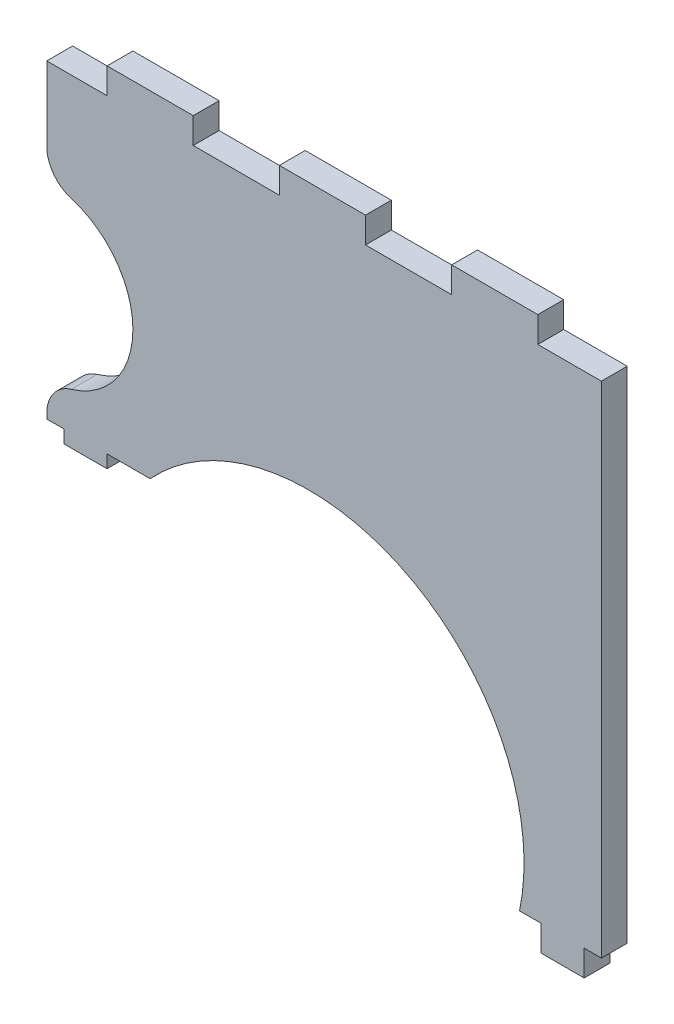
ISO-10303-21;
HEADER;
FILE_DESCRIPTION(('STEP AP214'),'2;1');
FILE_NAME('part.step','',(''),(''),'','','');
FILE_SCHEMA(('AUTOMOTIVE_DESIGN { 1 0 10303 214 1 1 1 1 }'));
ENDSEC;
DATA;
#1=APPLICATION_CONTEXT('core data for automotive mechanical design processes');
#2=APPLICATION_PROTOCOL_DEFINITION('international standard','automotive_design',2000,#1);
#3=PRODUCT_CONTEXT('',#1,'mechanical');
#4=PRODUCT('Part','Part','',(#3));
#5=PRODUCT_RELATED_PRODUCT_CATEGORY('part','',(#4));
#6=PRODUCT_DEFINITION_FORMATION('','',#4);
#7=PRODUCT_DEFINITION_CONTEXT('part definition',#1,'design');
#8=PRODUCT_DEFINITION('design','',#6,#7);
#9=PRODUCT_DEFINITION_SHAPE('','',#8);
#10=(LENGTH_UNIT() NAMED_UNIT(*) SI_UNIT(.MILLI.,.METRE.));
#11=(NAMED_UNIT(*) PLANE_ANGLE_UNIT() SI_UNIT($,.RADIAN.));
#12=(NAMED_UNIT(*) SI_UNIT($,.STERADIAN.) SOLID_ANGLE_UNIT());
#13=UNCERTAINTY_MEASURE_WITH_UNIT(LENGTH_MEASURE(1.E-05),#10,'distance_accuracy_value','');
#14=(GEOMETRIC_REPRESENTATION_CONTEXT(3) GLOBAL_UNCERTAINTY_ASSIGNED_CONTEXT((#13)) GLOBAL_UNIT_ASSIGNED_CONTEXT((#10,
#11,#12)) REPRESENTATION_CONTEXT('',''));
#15=CARTESIAN_POINT('',(0.,0.,0.));
#16=DIRECTION('',(0.,0.,1.));
#17=DIRECTION('',(1.,0.,0.));
#18=AXIS2_PLACEMENT_3D('',#15,#16,#17);
#19=CARTESIAN_POINT('',(-62.38,0.,3.));
#20=DIRECTION('',(1.,0.,0.));
#21=DIRECTION('',(0.,0.,-1.));
#22=AXIS2_PLACEMENT_3D('',#19,#20,#21);
#23=PLANE('',#22);
#24=DIRECTION('',(0.,-1.,0.));
#25=VECTOR('',#24,1.);
#26=CARTESIAN_POINT('',(-62.38,0.,0.));
#27=LINE('',#26,#25);
#28=CARTESIAN_POINT('',(-62.38,58.,0.));
#29=VERTEX_POINT('',#28);
#30=CARTESIAN_POINT('',(-62.38,49.4164078649987,0.));
#31=VERTEX_POINT('',#30);
#32=EDGE_CURVE('E363',#29,#31,#27,.T.);
#33=ORIENTED_EDGE('',*,*,#32,.T.);
#34=DIRECTION('',(0.,0.,1.));
#35=VECTOR('',#34,1.);
#36=CARTESIAN_POINT('',(-62.38,49.4164078649987,3.));
#37=LINE('',#36,#35);
#38=CARTESIAN_POINT('',(-62.38,49.4164078649987,3.));
#39=VERTEX_POINT('',#38);
#40=EDGE_CURVE('E11',#31,#39,#37,.T.);
#41=ORIENTED_EDGE('',*,*,#40,.T.);
#42=DIRECTION('',(0.,-1.,0.));
#43=VECTOR('',#42,1.);
#44=CARTESIAN_POINT('',(-62.38,0.,3.));
#45=LINE('',#44,#43);
#46=CARTESIAN_POINT('',(-62.38,58.,3.));
#47=VERTEX_POINT('',#46);
#48=EDGE_CURVE('E302',#47,#39,#45,.T.);
#49=ORIENTED_EDGE('',*,*,#48,.F.);
#50=DIRECTION('',(0.,0.,-1.));
#51=VECTOR('',#50,1.);
#52=CARTESIAN_POINT('',(-62.38,58.,3.));
#53=LINE('',#52,#51);
#54=EDGE_CURVE('E383',#47,#29,#53,.T.);
#55=ORIENTED_EDGE('',*,*,#54,.T.);
#56=EDGE_LOOP('',(#33,#41,#49,#55));
#57=FACE_BOUND('',#56,.T.);
#58=ADVANCED_FACE('F39',(#57),#23,.F.);
#59=CARTESIAN_POINT('',(0.,21.9999999999999,3.));
#60=DIRECTION('',(0.,1.,0.));
#61=DIRECTION('',(-1.,0.,0.));
#62=AXIS2_PLACEMENT_3D('',#59,#60,#61);
#63=PLANE('',#62);
#64=DIRECTION('',(1.,0.,0.));
#65=VECTOR('',#64,1.);
#66=CARTESIAN_POINT('',(0.,21.9999999999999,0.));
#67=LINE('',#66,#65);
#68=CARTESIAN_POINT('',(-55.38,22.,0.));
#69=VERTEX_POINT('',#68);
#70=CARTESIAN_POINT('',(-50.38,22.,0.));
#71=VERTEX_POINT('',#70);
#72=EDGE_CURVE('E265',#69,#71,#67,.T.);
#73=ORIENTED_EDGE('',*,*,#72,.T.);
#74=DIRECTION('',(0.,0.,-1.));
#75=VECTOR('',#74,1.);
#76=CARTESIAN_POINT('',(-50.38,22.,3.));
#77=LINE('',#76,#75);
#78=CARTESIAN_POINT('',(-50.38,22.,3.));
#79=VERTEX_POINT('',#78);
#80=EDGE_CURVE('E244',#79,#71,#77,.T.);
#81=ORIENTED_EDGE('',*,*,#80,.F.);
#82=DIRECTION('',(1.,0.,0.));
#83=VECTOR('',#82,1.);
#84=CARTESIAN_POINT('',(0.,21.9999999999999,3.));
#85=LINE('',#84,#83);
#86=CARTESIAN_POINT('',(-55.38,22.,3.));
#87=VERTEX_POINT('',#86);
#88=EDGE_CURVE('E251',#87,#79,#85,.T.);
#89=ORIENTED_EDGE('',*,*,#88,.F.);
#90=DIRECTION('',(0.,0.,-1.));
#91=VECTOR('',#90,1.);
#92=CARTESIAN_POINT('',(-55.38,22.,3.));
#93=LINE('',#92,#91);
#94=EDGE_CURVE('E317',#87,#69,#93,.T.);
#95=ORIENTED_EDGE('',*,*,#94,.T.);
#96=EDGE_LOOP('',(#73,#81,#89,#95));
#97=FACE_BOUND('',#96,.T.);
#98=ADVANCED_FACE('F263',(#97),#63,.F.);
#99=CARTESIAN_POINT('',(-31.9791901639315,5.07634208048251,3.));
#100=DIRECTION('',(0.,0.,-1.));
#101=DIRECTION('',(-1.,0.,0.));
#102=AXIS2_PLACEMENT_3D('',#99,#100,#101);
#103=CYLINDRICAL_SURFACE('',#102,25.);
#104=CARTESIAN_POINT('',(-31.9791901639315,5.07634208048251,0.));
#105=DIRECTION('',(0.,0.,1.));
#106=DIRECTION('',(1.,0.,0.));
#107=AXIS2_PLACEMENT_3D('',#104,#105,#106);
#108=CIRCLE('',#107,25.);
#109=CARTESIAN_POINT('',(-7.50000000000001,0.,0.));
#110=VERTEX_POINT('',#109);
#111=EDGE_CURVE('E319',#71,#110,#108,.F.);
#112=ORIENTED_EDGE('',*,*,#111,.T.);
#113=DIRECTION('',(0.,0.,-1.));
#114=VECTOR('',#113,1.);
#115=CARTESIAN_POINT('',(-7.50000000000001,0.,3.));
#116=LINE('',#115,#114);
#117=CARTESIAN_POINT('',(-7.50000000000001,0.,3.));
#118=VERTEX_POINT('',#117);
#119=EDGE_CURVE('E246',#118,#110,#116,.T.);
#120=ORIENTED_EDGE('',*,*,#119,.F.);
#121=CARTESIAN_POINT('',(-31.9791901639315,5.07634208048251,3.));
#122=DIRECTION('',(0.,0.,1.));
#123=DIRECTION('',(1.,0.,0.));
#124=AXIS2_PLACEMENT_3D('',#121,#122,#123);
#125=CIRCLE('',#124,25.);
#126=EDGE_CURVE('E239',#79,#118,#125,.F.);
#127=ORIENTED_EDGE('',*,*,#126,.F.);
#128=ORIENTED_EDGE('',*,*,#80,.T.);
#129=EDGE_LOOP('',(#112,#120,#127,#128));
#130=FACE_BOUND('',#129,.T.);
#131=ADVANCED_FACE('F242',(#130),#103,.F.);
#132=CARTESIAN_POINT('',(0.,0.,3.));
#133=DIRECTION('',(0.,-1.,0.));
#134=DIRECTION('',(1.,0.,0.));
#135=AXIS2_PLACEMENT_3D('',#132,#133,#134);
#136=PLANE('',#135);
#137=DIRECTION('',(-1.,0.,0.));
#138=VECTOR('',#137,1.);
#139=CARTESIAN_POINT('',(0.,0.,0.));
#140=LINE('',#139,#138);
#141=CARTESIAN_POINT('',(-5.,0.,0.));
#142=VERTEX_POINT('',#141);
#143=EDGE_CURVE('E321',#142,#110,#140,.T.);
#144=ORIENTED_EDGE('',*,*,#143,.F.);
#145=DIRECTION('',(0.,0.,-1.));
#146=VECTOR('',#145,1.);
#147=CARTESIAN_POINT('',(-5.,0.,3.));
#148=LINE('',#147,#146);
#149=CARTESIAN_POINT('',(-5.,0.,3.));
#150=VERTEX_POINT('',#149);
#151=EDGE_CURVE('E270',#150,#142,#148,.T.);
#152=ORIENTED_EDGE('',*,*,#151,.F.);
#153=DIRECTION('',(-1.,0.,0.));
#154=VECTOR('',#153,1.);
#155=CARTESIAN_POINT('',(0.,0.,3.));
#156=LINE('',#155,#154);
#157=EDGE_CURVE('E250',#150,#118,#156,.T.);
#158=ORIENTED_EDGE('',*,*,#157,.T.);
#159=ORIENTED_EDGE('',*,*,#119,.T.);
#160=EDGE_LOOP('',(#144,#152,#158,#159));
#161=FACE_BOUND('',#160,.T.);
#162=ADVANCED_FACE('F441',(#161),#136,.T.);
#163=CARTESIAN_POINT('',(-5.,0.,3.));
#164=DIRECTION('',(-1.,0.,0.));
#165=DIRECTION('',(0.,0.,1.));
#166=AXIS2_PLACEMENT_3D('',#163,#164,#165);
#167=PLANE('',#166);
#168=DIRECTION('',(0.,1.,0.));
#169=VECTOR('',#168,1.);
#170=CARTESIAN_POINT('',(-5.,0.,0.));
#171=LINE('',#170,#169);
#172=CARTESIAN_POINT('',(-5.,-3.,0.));
#173=VERTEX_POINT('',#172);
#174=EDGE_CURVE('E324',#173,#142,#171,.T.);
#175=ORIENTED_EDGE('',*,*,#174,.F.);
#176=DIRECTION('',(0.,0.,-1.));
#177=VECTOR('',#176,1.);
#178=CARTESIAN_POINT('',(-5.,-3.,3.));
#179=LINE('',#178,#177);
#180=CARTESIAN_POINT('',(-5.,-3.,3.));
#181=VERTEX_POINT('',#180);
#182=EDGE_CURVE('E432',#181,#173,#179,.T.);
#183=ORIENTED_EDGE('',*,*,#182,.F.);
#184=DIRECTION('',(0.,1.,0.));
#185=VECTOR('',#184,1.);
#186=CARTESIAN_POINT('',(-5.,0.,3.));
#187=LINE('',#186,#185);
#188=EDGE_CURVE('E439',#181,#150,#187,.T.);
#189=ORIENTED_EDGE('',*,*,#188,.T.);
#190=ORIENTED_EDGE('',*,*,#151,.T.);
#191=EDGE_LOOP('',(#175,#183,#189,#190));
#192=FACE_BOUND('',#191,.T.);
#193=ADVANCED_FACE('F437',(#192),#167,.T.);
#194=CARTESIAN_POINT('',(0.,-3.,3.));
#195=DIRECTION('',(0.,-1.,0.));
#196=DIRECTION('',(1.,0.,0.));
#197=AXIS2_PLACEMENT_3D('',#194,#195,#196);
#198=PLANE('',#197);
#199=DIRECTION('',(-1.,0.,0.));
#200=VECTOR('',#199,1.);
#201=CARTESIAN_POINT('',(0.,-3.,0.));
#202=LINE('',#201,#200);
#203=CARTESIAN_POINT('',(0.,-3.,0.));
#204=VERTEX_POINT('',#203);
#205=EDGE_CURVE('E327',#204,#173,#202,.T.);
#206=ORIENTED_EDGE('',*,*,#205,.F.);
#207=DIRECTION('',(0.,0.,-1.));
#208=VECTOR('',#207,1.);
#209=CARTESIAN_POINT('',(0.,-3.,3.));
#210=LINE('',#209,#208);
#211=CARTESIAN_POINT('',(0.,-3.,3.));
#212=VERTEX_POINT('',#211);
#213=EDGE_CURVE('E430',#212,#204,#210,.T.);
#214=ORIENTED_EDGE('',*,*,#213,.F.);
#215=DIRECTION('',(-1.,0.,0.));
#216=VECTOR('',#215,1.);
#217=CARTESIAN_POINT('',(0.,-3.,3.));
#218=LINE('',#217,#216);
#219=EDGE_CURVE('E449',#212,#181,#218,.T.);
#220=ORIENTED_EDGE('',*,*,#219,.T.);
#221=ORIENTED_EDGE('',*,*,#182,.T.);
#222=EDGE_LOOP('',(#206,#214,#220,#221));
#223=FACE_BOUND('',#222,.T.);
#224=ADVANCED_FACE('F446',(#223),#198,.T.);
#225=CARTESIAN_POINT('',(0.,0.,3.));
#226=DIRECTION('',(1.,0.,0.));
#227=DIRECTION('',(0.,1.,0.));
#228=AXIS2_PLACEMENT_3D('',#225,#226,#227);
#229=PLANE('',#228);
#230=DIRECTION('',(0.,-1.,0.));
#231=VECTOR('',#230,1.);
#232=CARTESIAN_POINT('',(0.,0.,0.));
#233=LINE('',#232,#231);
#234=CARTESIAN_POINT('',(0.,0.,0.));
#235=VERTEX_POINT('',#234);
#236=EDGE_CURVE('E330',#235,#204,#233,.T.);
#237=ORIENTED_EDGE('',*,*,#236,.F.);
#238=DIRECTION('',(0.,0.,-1.));
#239=VECTOR('',#238,1.);
#240=CARTESIAN_POINT('',(0.,0.,3.));
#241=LINE('',#240,#239);
#242=CARTESIAN_POINT('',(0.,0.,3.));
#243=VERTEX_POINT('',#242);
#244=EDGE_CURVE('E428',#243,#235,#241,.T.);
#245=ORIENTED_EDGE('',*,*,#244,.F.);
#246=DIRECTION('',(0.,-1.,0.));
#247=VECTOR('',#246,1.);
#248=CARTESIAN_POINT('',(0.,0.,3.));
#249=LINE('',#248,#247);
#250=EDGE_CURVE('E453',#243,#212,#249,.T.);
#251=ORIENTED_EDGE('',*,*,#250,.T.);
#252=ORIENTED_EDGE('',*,*,#213,.T.);
#253=EDGE_LOOP('',(#237,#245,#251,#252));
#254=FACE_BOUND('',#253,.T.);
#255=ADVANCED_FACE('F576',(#254),#229,.T.);
#256=CARTESIAN_POINT('',(0.,0.,3.));
#257=DIRECTION('',(0.,1.,0.));
#258=DIRECTION('',(0.,0.,1.));
#259=AXIS2_PLACEMENT_3D('',#256,#257,#258);
#260=PLANE('',#259);
#261=DIRECTION('',(1.,0.,0.));
#262=VECTOR('',#261,1.);
#263=CARTESIAN_POINT('',(0.,0.,0.));
#264=LINE('',#263,#262);
#265=CARTESIAN_POINT('',(2.,0.,0.));
#266=VERTEX_POINT('',#265);
#267=EDGE_CURVE('E333',#235,#266,#264,.T.);
#268=ORIENTED_EDGE('',*,*,#267,.T.);
#269=DIRECTION('',(0.,0.,-1.));
#270=VECTOR('',#269,1.);
#271=CARTESIAN_POINT('',(2.,0.,3.));
#272=LINE('',#271,#270);
#273=CARTESIAN_POINT('',(2.,0.,3.));
#274=VERTEX_POINT('',#273);
#275=EDGE_CURVE('E425',#274,#266,#272,.T.);
#276=ORIENTED_EDGE('',*,*,#275,.F.);
#277=DIRECTION('',(1.,0.,0.));
#278=VECTOR('',#277,1.);
#279=CARTESIAN_POINT('',(0.,0.,3.));
#280=LINE('',#279,#278);
#281=EDGE_CURVE('E458',#243,#274,#280,.T.);
#282=ORIENTED_EDGE('',*,*,#281,.F.);
#283=ORIENTED_EDGE('',*,*,#244,.T.);
#284=EDGE_LOOP('',(#268,#276,#282,#283));
#285=FACE_BOUND('',#284,.T.);
#286=ADVANCED_FACE('F572',(#285),#260,.F.);
#287=CARTESIAN_POINT('',(2.,0.,3.));
#288=DIRECTION('',(-1.,0.,0.));
#289=DIRECTION('',(0.,0.,1.));
#290=AXIS2_PLACEMENT_3D('',#287,#288,#289);
#291=PLANE('',#290);
#292=DIRECTION('',(0.,1.,0.));
#293=VECTOR('',#292,1.);
#294=CARTESIAN_POINT('',(2.,0.,0.));
#295=LINE('',#294,#293);
#296=CARTESIAN_POINT('',(2.,58.,0.));
#297=VERTEX_POINT('',#296);
#298=EDGE_CURVE('E335',#266,#297,#295,.T.);
#299=ORIENTED_EDGE('',*,*,#298,.T.);
#300=DIRECTION('',(0.,0.,-1.));
#301=VECTOR('',#300,1.);
#302=CARTESIAN_POINT('',(2.,58.,3.));
#303=LINE('',#302,#301);
#304=CARTESIAN_POINT('',(2.,58.,3.));
#305=VERTEX_POINT('',#304);
#306=EDGE_CURVE('E422',#305,#297,#303,.T.);
#307=ORIENTED_EDGE('',*,*,#306,.F.);
#308=DIRECTION('',(0.,1.,0.));
#309=VECTOR('',#308,1.);
#310=CARTESIAN_POINT('',(2.,0.,3.));
#311=LINE('',#310,#309);
#312=EDGE_CURVE('E460',#274,#305,#311,.T.);
#313=ORIENTED_EDGE('',*,*,#312,.F.);
#314=ORIENTED_EDGE('',*,*,#275,.T.);
#315=EDGE_LOOP('',(#299,#307,#313,#314));
#316=FACE_BOUND('',#315,.T.);
#317=ADVANCED_FACE('F568',(#316),#291,.F.);
#318=CARTESIAN_POINT('',(0.,58.,3.));
#319=DIRECTION('',(0.,-1.,0.));
#320=DIRECTION('',(0.,0.,-1.));
#321=AXIS2_PLACEMENT_3D('',#318,#319,#320);
#322=PLANE('',#321);
#323=DIRECTION('',(-1.,0.,0.));
#324=VECTOR('',#323,1.);
#325=CARTESIAN_POINT('',(0.,58.,0.));
#326=LINE('',#325,#324);
#327=CARTESIAN_POINT('',(-5.37999999999999,58.,0.));
#328=VERTEX_POINT('',#327);
#329=EDGE_CURVE('E337',#297,#328,#326,.T.);
#330=ORIENTED_EDGE('',*,*,#329,.T.);
#331=DIRECTION('',(0.,0.,-1.));
#332=VECTOR('',#331,1.);
#333=CARTESIAN_POINT('',(-5.37999999999999,58.,3.));
#334=LINE('',#333,#332);
#335=CARTESIAN_POINT('',(-5.37999999999999,58.,3.));
#336=VERTEX_POINT('',#335);
#337=EDGE_CURVE('E419',#336,#328,#334,.T.);
#338=ORIENTED_EDGE('',*,*,#337,.F.);
#339=DIRECTION('',(-1.,0.,0.));
#340=VECTOR('',#339,1.);
#341=CARTESIAN_POINT('',(0.,58.,3.));
#342=LINE('',#341,#340);
#343=EDGE_CURVE('E462',#305,#336,#342,.T.);
#344=ORIENTED_EDGE('',*,*,#343,.F.);
#345=ORIENTED_EDGE('',*,*,#306,.T.);
#346=EDGE_LOOP('',(#330,#338,#344,#345));
#347=FACE_BOUND('',#346,.T.);
#348=ADVANCED_FACE('F564',(#347),#322,.F.);
#349=CARTESIAN_POINT('',(-5.37999999999999,0.,3.));
#350=DIRECTION('',(-1.,0.,0.));
#351=DIRECTION('',(0.,0.,1.));
#352=AXIS2_PLACEMENT_3D('',#349,#350,#351);
#353=PLANE('',#352);
#354=DIRECTION('',(0.,1.,0.));
#355=VECTOR('',#354,1.);
#356=CARTESIAN_POINT('',(-5.37999999999999,0.,0.));
#357=LINE('',#356,#355);
#358=CARTESIAN_POINT('',(-5.37999999999999,61.,0.));
#359=VERTEX_POINT('',#358);
#360=EDGE_CURVE('E339',#328,#359,#357,.T.);
#361=ORIENTED_EDGE('',*,*,#360,.T.);
#362=DIRECTION('',(0.,0.,-1.));
#363=VECTOR('',#362,1.);
#364=CARTESIAN_POINT('',(-5.37999999999999,61.,3.));
#365=LINE('',#364,#363);
#366=CARTESIAN_POINT('',(-5.37999999999999,61.,3.));
#367=VERTEX_POINT('',#366);
#368=EDGE_CURVE('E416',#367,#359,#365,.T.);
#369=ORIENTED_EDGE('',*,*,#368,.F.);
#370=DIRECTION('',(0.,1.,0.));
#371=VECTOR('',#370,1.);
#372=CARTESIAN_POINT('',(-5.37999999999999,0.,3.));
#373=LINE('',#372,#371);
#374=EDGE_CURVE('E464',#336,#367,#373,.T.);
#375=ORIENTED_EDGE('',*,*,#374,.F.);
#376=ORIENTED_EDGE('',*,*,#337,.T.);
#377=EDGE_LOOP('',(#361,#369,#375,#376));
#378=FACE_BOUND('',#377,.T.);
#379=ADVANCED_FACE('F560',(#378),#353,.F.);
#380=CARTESIAN_POINT('',(0.,61.,3.));
#381=DIRECTION('',(0.,-1.,0.));
#382=DIRECTION('',(1.,0.,0.));
#383=AXIS2_PLACEMENT_3D('',#380,#381,#382);
#384=PLANE('',#383);
#385=DIRECTION('',(-1.,0.,0.));
#386=VECTOR('',#385,1.);
#387=CARTESIAN_POINT('',(0.,61.,0.));
#388=LINE('',#387,#386);
#389=CARTESIAN_POINT('',(-15.38,61.,0.));
#390=VERTEX_POINT('',#389);
#391=EDGE_CURVE('E341',#359,#390,#388,.T.);
#392=ORIENTED_EDGE('',*,*,#391,.T.);
#393=DIRECTION('',(0.,0.,-1.));
#394=VECTOR('',#393,1.);
#395=CARTESIAN_POINT('',(-15.38,61.,3.));
#396=LINE('',#395,#394);
#397=CARTESIAN_POINT('',(-15.38,61.,3.));
#398=VERTEX_POINT('',#397);
#399=EDGE_CURVE('E413',#398,#390,#396,.T.);
#400=ORIENTED_EDGE('',*,*,#399,.F.);
#401=DIRECTION('',(-1.,0.,0.));
#402=VECTOR('',#401,1.);
#403=CARTESIAN_POINT('',(0.,61.,3.));
#404=LINE('',#403,#402);
#405=EDGE_CURVE('E466',#367,#398,#404,.T.);
#406=ORIENTED_EDGE('',*,*,#405,.F.);
#407=ORIENTED_EDGE('',*,*,#368,.T.);
#408=EDGE_LOOP('',(#392,#400,#406,#407));
#409=FACE_BOUND('',#408,.T.);
#410=ADVANCED_FACE('F556',(#409),#384,.F.);
#411=CARTESIAN_POINT('',(-15.38,0.,3.));
#412=DIRECTION('',(1.,0.,0.));
#413=DIRECTION('',(0.,0.,-1.));
#414=AXIS2_PLACEMENT_3D('',#411,#412,#413);
#415=PLANE('',#414);
#416=DIRECTION('',(0.,-1.,0.));
#417=VECTOR('',#416,1.);
#418=CARTESIAN_POINT('',(-15.38,0.,0.));
#419=LINE('',#418,#417);
#420=CARTESIAN_POINT('',(-15.38,58.,0.));
#421=VERTEX_POINT('',#420);
#422=EDGE_CURVE('E343',#390,#421,#419,.T.);
#423=ORIENTED_EDGE('',*,*,#422,.T.);
#424=DIRECTION('',(0.,0.,-1.));
#425=VECTOR('',#424,1.);
#426=CARTESIAN_POINT('',(-15.38,58.,3.));
#427=LINE('',#426,#425);
#428=CARTESIAN_POINT('',(-15.38,58.,3.));
#429=VERTEX_POINT('',#428);
#430=EDGE_CURVE('E410',#429,#421,#427,.T.);
#431=ORIENTED_EDGE('',*,*,#430,.F.);
#432=DIRECTION('',(0.,-1.,0.));
#433=VECTOR('',#432,1.);
#434=CARTESIAN_POINT('',(-15.38,0.,3.));
#435=LINE('',#434,#433);
#436=EDGE_CURVE('E468',#398,#429,#435,.T.);
#437=ORIENTED_EDGE('',*,*,#436,.F.);
#438=ORIENTED_EDGE('',*,*,#399,.T.);
#439=EDGE_LOOP('',(#423,#431,#437,#438));
#440=FACE_BOUND('',#439,.T.);
#441=ADVANCED_FACE('F552',(#440),#415,.F.);
#442=CARTESIAN_POINT('',(0.,58.,3.));
#443=DIRECTION('',(0.,-1.,0.));
#444=DIRECTION('',(1.,0.,0.));
#445=AXIS2_PLACEMENT_3D('',#442,#443,#444);
#446=PLANE('',#445);
#447=DIRECTION('',(-1.,0.,0.));
#448=VECTOR('',#447,1.);
#449=CARTESIAN_POINT('',(0.,58.,0.));
#450=LINE('',#449,#448);
#451=CARTESIAN_POINT('',(-25.38,58.,0.));
#452=VERTEX_POINT('',#451);
#453=EDGE_CURVE('E345',#421,#452,#450,.T.);
#454=ORIENTED_EDGE('',*,*,#453,.T.);
#455=DIRECTION('',(0.,0.,-1.));
#456=VECTOR('',#455,1.);
#457=CARTESIAN_POINT('',(-25.38,58.,3.));
#458=LINE('',#457,#456);
#459=CARTESIAN_POINT('',(-25.38,58.,3.));
#460=VERTEX_POINT('',#459);
#461=EDGE_CURVE('E407',#460,#452,#458,.T.);
#462=ORIENTED_EDGE('',*,*,#461,.F.);
#463=DIRECTION('',(-1.,0.,0.));
#464=VECTOR('',#463,1.);
#465=CARTESIAN_POINT('',(0.,58.,3.));
#466=LINE('',#465,#464);
#467=EDGE_CURVE('E470',#429,#460,#466,.T.);
#468=ORIENTED_EDGE('',*,*,#467,.F.);
#469=ORIENTED_EDGE('',*,*,#430,.T.);
#470=EDGE_LOOP('',(#454,#462,#468,#469));
#471=FACE_BOUND('',#470,.T.);
#472=ADVANCED_FACE('F548',(#471),#446,.F.);
#473=CARTESIAN_POINT('',(-25.38,0.,3.));
#474=DIRECTION('',(-1.,0.,0.));
#475=DIRECTION('',(0.,0.,1.));
#476=AXIS2_PLACEMENT_3D('',#473,#474,#475);
#477=PLANE('',#476);
#478=DIRECTION('',(0.,1.,0.));
#479=VECTOR('',#478,1.);
#480=CARTESIAN_POINT('',(-25.38,0.,0.));
#481=LINE('',#480,#479);
#482=CARTESIAN_POINT('',(-25.38,61.,0.));
#483=VERTEX_POINT('',#482);
#484=EDGE_CURVE('E347',#452,#483,#481,.T.);
#485=ORIENTED_EDGE('',*,*,#484,.T.);
#486=DIRECTION('',(0.,0.,-1.));
#487=VECTOR('',#486,1.);
#488=CARTESIAN_POINT('',(-25.38,61.,3.));
#489=LINE('',#488,#487);
#490=CARTESIAN_POINT('',(-25.38,61.,3.));
#491=VERTEX_POINT('',#490);
#492=EDGE_CURVE('E404',#491,#483,#489,.T.);
#493=ORIENTED_EDGE('',*,*,#492,.F.);
#494=DIRECTION('',(0.,1.,0.));
#495=VECTOR('',#494,1.);
#496=CARTESIAN_POINT('',(-25.38,0.,3.));
#497=LINE('',#496,#495);
#498=EDGE_CURVE('E472',#460,#491,#497,.T.);
#499=ORIENTED_EDGE('',*,*,#498,.F.);
#500=ORIENTED_EDGE('',*,*,#461,.T.);
#501=EDGE_LOOP('',(#485,#493,#499,#500));
#502=FACE_BOUND('',#501,.T.);
#503=ADVANCED_FACE('F544',(#502),#477,.F.);
#504=CARTESIAN_POINT('',(0.,61.,3.));
#505=DIRECTION('',(0.,-1.,0.));
#506=DIRECTION('',(1.,0.,0.));
#507=AXIS2_PLACEMENT_3D('',#504,#505,#506);
#508=PLANE('',#507);
#509=DIRECTION('',(-1.,0.,0.));
#510=VECTOR('',#509,1.);
#511=CARTESIAN_POINT('',(0.,61.,0.));
#512=LINE('',#511,#510);
#513=CARTESIAN_POINT('',(-35.38,61.,0.));
#514=VERTEX_POINT('',#513);
#515=EDGE_CURVE('E349',#483,#514,#512,.T.);
#516=ORIENTED_EDGE('',*,*,#515,.T.);
#517=DIRECTION('',(0.,0.,-1.));
#518=VECTOR('',#517,1.);
#519=CARTESIAN_POINT('',(-35.38,61.,3.));
#520=LINE('',#519,#518);
#521=CARTESIAN_POINT('',(-35.38,61.,3.));
#522=VERTEX_POINT('',#521);
#523=EDGE_CURVE('E401',#522,#514,#520,.T.);
#524=ORIENTED_EDGE('',*,*,#523,.F.);
#525=DIRECTION('',(-1.,0.,0.));
#526=VECTOR('',#525,1.);
#527=CARTESIAN_POINT('',(0.,61.,3.));
#528=LINE('',#527,#526);
#529=EDGE_CURVE('E474',#491,#522,#528,.T.);
#530=ORIENTED_EDGE('',*,*,#529,.F.);
#531=ORIENTED_EDGE('',*,*,#492,.T.);
#532=EDGE_LOOP('',(#516,#524,#530,#531));
#533=FACE_BOUND('',#532,.T.);
#534=ADVANCED_FACE('F540',(#533),#508,.F.);
#535=CARTESIAN_POINT('',(-35.38,0.,3.));
#536=DIRECTION('',(1.,0.,0.));
#537=DIRECTION('',(0.,0.,-1.));
#538=AXIS2_PLACEMENT_3D('',#535,#536,#537);
#539=PLANE('',#538);
#540=DIRECTION('',(0.,-1.,0.));
#541=VECTOR('',#540,1.);
#542=CARTESIAN_POINT('',(-35.38,0.,0.));
#543=LINE('',#542,#541);
#544=CARTESIAN_POINT('',(-35.38,58.,0.));
#545=VERTEX_POINT('',#544);
#546=EDGE_CURVE('E351',#514,#545,#543,.T.);
#547=ORIENTED_EDGE('',*,*,#546,.T.);
#548=DIRECTION('',(0.,0.,-1.));
#549=VECTOR('',#548,1.);
#550=CARTESIAN_POINT('',(-35.38,58.,3.));
#551=LINE('',#550,#549);
#552=CARTESIAN_POINT('',(-35.38,58.,3.));
#553=VERTEX_POINT('',#552);
#554=EDGE_CURVE('E398',#553,#545,#551,.T.);
#555=ORIENTED_EDGE('',*,*,#554,.F.);
#556=DIRECTION('',(0.,-1.,0.));
#557=VECTOR('',#556,1.);
#558=CARTESIAN_POINT('',(-35.38,0.,3.));
#559=LINE('',#558,#557);
#560=EDGE_CURVE('E476',#522,#553,#559,.T.);
#561=ORIENTED_EDGE('',*,*,#560,.F.);
#562=ORIENTED_EDGE('',*,*,#523,.T.);
#563=EDGE_LOOP('',(#547,#555,#561,#562));
#564=FACE_BOUND('',#563,.T.);
#565=ADVANCED_FACE('F536',(#564),#539,.F.);
#566=CARTESIAN_POINT('',(0.,58.,3.));
#567=DIRECTION('',(0.,-1.,0.));
#568=DIRECTION('',(0.,0.,-1.));
#569=AXIS2_PLACEMENT_3D('',#566,#567,#568);
#570=PLANE('',#569);
#571=DIRECTION('',(-1.,0.,0.));
#572=VECTOR('',#571,1.);
#573=CARTESIAN_POINT('',(0.,58.,0.));
#574=LINE('',#573,#572);
#575=CARTESIAN_POINT('',(-45.38,58.,0.));
#576=VERTEX_POINT('',#575);
#577=EDGE_CURVE('E353',#545,#576,#574,.T.);
#578=ORIENTED_EDGE('',*,*,#577,.T.);
#579=DIRECTION('',(0.,0.,-1.));
#580=VECTOR('',#579,1.);
#581=CARTESIAN_POINT('',(-45.38,58.,3.));
#582=LINE('',#581,#580);
#583=CARTESIAN_POINT('',(-45.38,58.,3.));
#584=VERTEX_POINT('',#583);
#585=EDGE_CURVE('E395',#584,#576,#582,.T.);
#586=ORIENTED_EDGE('',*,*,#585,.F.);
#587=DIRECTION('',(-1.,0.,0.));
#588=VECTOR('',#587,1.);
#589=CARTESIAN_POINT('',(0.,58.,3.));
#590=LINE('',#589,#588);
#591=EDGE_CURVE('E478',#553,#584,#590,.T.);
#592=ORIENTED_EDGE('',*,*,#591,.F.);
#593=ORIENTED_EDGE('',*,*,#554,.T.);
#594=EDGE_LOOP('',(#578,#586,#592,#593));
#595=FACE_BOUND('',#594,.T.);
#596=ADVANCED_FACE('F532',(#595),#570,.F.);
#597=CARTESIAN_POINT('',(-45.38,0.,3.));
#598=DIRECTION('',(-1.,0.,0.));
#599=DIRECTION('',(0.,0.,1.));
#600=AXIS2_PLACEMENT_3D('',#597,#598,#599);
#601=PLANE('',#600);
#602=DIRECTION('',(0.,1.,0.));
#603=VECTOR('',#602,1.);
#604=CARTESIAN_POINT('',(-45.38,0.,0.));
#605=LINE('',#604,#603);
#606=CARTESIAN_POINT('',(-45.38,61.,0.));
#607=VERTEX_POINT('',#606);
#608=EDGE_CURVE('E355',#576,#607,#605,.T.);
#609=ORIENTED_EDGE('',*,*,#608,.T.);
#610=DIRECTION('',(0.,0.,-1.));
#611=VECTOR('',#610,1.);
#612=CARTESIAN_POINT('',(-45.38,61.,3.));
#613=LINE('',#612,#611);
#614=CARTESIAN_POINT('',(-45.38,61.,3.));
#615=VERTEX_POINT('',#614);
#616=EDGE_CURVE('E392',#615,#607,#613,.T.);
#617=ORIENTED_EDGE('',*,*,#616,.F.);
#618=DIRECTION('',(0.,1.,0.));
#619=VECTOR('',#618,1.);
#620=CARTESIAN_POINT('',(-45.38,0.,3.));
#621=LINE('',#620,#619);
#622=EDGE_CURVE('E480',#584,#615,#621,.T.);
#623=ORIENTED_EDGE('',*,*,#622,.F.);
#624=ORIENTED_EDGE('',*,*,#585,.T.);
#625=EDGE_LOOP('',(#609,#617,#623,#624));
#626=FACE_BOUND('',#625,.T.);
#627=ADVANCED_FACE('F528',(#626),#601,.F.);
#628=CARTESIAN_POINT('',(0.,61.,3.));
#629=DIRECTION('',(0.,-1.,0.));
#630=DIRECTION('',(0.,0.,-1.));
#631=AXIS2_PLACEMENT_3D('',#628,#629,#630);
#632=PLANE('',#631);
#633=DIRECTION('',(-1.,0.,0.));
#634=VECTOR('',#633,1.);
#635=CARTESIAN_POINT('',(0.,61.,0.));
#636=LINE('',#635,#634);
#637=CARTESIAN_POINT('',(-55.38,61.,0.));
#638=VERTEX_POINT('',#637);
#639=EDGE_CURVE('E357',#607,#638,#636,.T.);
#640=ORIENTED_EDGE('',*,*,#639,.T.);
#641=DIRECTION('',(0.,0.,-1.));
#642=VECTOR('',#641,1.);
#643=CARTESIAN_POINT('',(-55.38,61.,3.));
#644=LINE('',#643,#642);
#645=CARTESIAN_POINT('',(-55.38,61.,3.));
#646=VERTEX_POINT('',#645);
#647=EDGE_CURVE('E389',#646,#638,#644,.T.);
#648=ORIENTED_EDGE('',*,*,#647,.F.);
#649=DIRECTION('',(-1.,0.,0.));
#650=VECTOR('',#649,1.);
#651=CARTESIAN_POINT('',(0.,61.,3.));
#652=LINE('',#651,#650);
#653=EDGE_CURVE('E482',#615,#646,#652,.T.);
#654=ORIENTED_EDGE('',*,*,#653,.F.);
#655=ORIENTED_EDGE('',*,*,#616,.T.);
#656=EDGE_LOOP('',(#640,#648,#654,#655));
#657=FACE_BOUND('',#656,.T.);
#658=ADVANCED_FACE('F523',(#657),#632,.F.);
#659=CARTESIAN_POINT('',(-55.38,0.,3.));
#660=DIRECTION('',(1.,0.,0.));
#661=DIRECTION('',(0.,0.,-1.));
#662=AXIS2_PLACEMENT_3D('',#659,#660,#661);
#663=PLANE('',#662);
#664=DIRECTION('',(0.,-1.,0.));
#665=VECTOR('',#664,1.);
#666=CARTESIAN_POINT('',(-55.38,0.,0.));
#667=LINE('',#666,#665);
#668=CARTESIAN_POINT('',(-55.38,58.,0.));
#669=VERTEX_POINT('',#668);
#670=EDGE_CURVE('E359',#638,#669,#667,.T.);
#671=ORIENTED_EDGE('',*,*,#670,.T.);
#672=DIRECTION('',(0.,0.,-1.));
#673=VECTOR('',#672,1.);
#674=CARTESIAN_POINT('',(-55.38,58.,3.));
#675=LINE('',#674,#673);
#676=CARTESIAN_POINT('',(-55.38,58.,3.));
#677=VERTEX_POINT('',#676);
#678=EDGE_CURVE('E386',#677,#669,#675,.T.);
#679=ORIENTED_EDGE('',*,*,#678,.F.);
#680=DIRECTION('',(0.,-1.,0.));
#681=VECTOR('',#680,1.);
#682=CARTESIAN_POINT('',(-55.38,0.,3.));
#683=LINE('',#682,#681);
#684=EDGE_CURVE('E307',#646,#677,#683,.T.);
#685=ORIENTED_EDGE('',*,*,#684,.F.);
#686=ORIENTED_EDGE('',*,*,#647,.T.);
#687=EDGE_LOOP('',(#671,#679,#685,#686));
#688=FACE_BOUND('',#687,.T.);
#689=ADVANCED_FACE('F490',(#688),#663,.F.);
#690=CARTESIAN_POINT('',(0.,58.,3.));
#691=DIRECTION('',(0.,-1.,0.));
#692=DIRECTION('',(0.,0.,-1.));
#693=AXIS2_PLACEMENT_3D('',#690,#691,#692);
#694=PLANE('',#693);
#695=DIRECTION('',(-1.,0.,0.));
#696=VECTOR('',#695,1.);
#697=CARTESIAN_POINT('',(0.,58.,0.));
#698=LINE('',#697,#696);
#699=EDGE_CURVE('E361',#669,#29,#698,.T.);
#700=ORIENTED_EDGE('',*,*,#699,.T.);
#701=ORIENTED_EDGE('',*,*,#54,.F.);
#702=DIRECTION('',(-1.,0.,0.));
#703=VECTOR('',#702,1.);
#704=CARTESIAN_POINT('',(0.,58.,3.));
#705=LINE('',#704,#703);
#706=EDGE_CURVE('E303',#677,#47,#705,.T.);
#707=ORIENTED_EDGE('',*,*,#706,.F.);
#708=ORIENTED_EDGE('',*,*,#678,.T.);
#709=EDGE_LOOP('',(#700,#701,#707,#708));
#710=FACE_BOUND('',#709,.T.);
#711=ADVANCED_FACE('F494',(#710),#694,.F.);
#712=CARTESIAN_POINT('',(-62.38,22.5835921350012,3.));
#713=VERTEX_POINT('',#712);
#714=CARTESIAN_POINT('',(-62.38,22.,3.));
#715=VERTEX_POINT('',#714);
#716=EDGE_CURVE('E296',#713,#715,#45,.T.);
#717=ORIENTED_EDGE('',*,*,#716,.F.);
#718=DIRECTION('',(0.,0.,1.));
#719=VECTOR('',#718,1.);
#720=CARTESIAN_POINT('',(-62.38,22.5835921350012,3.));
#721=LINE('',#720,#719);
#722=CARTESIAN_POINT('',(-62.38,22.5835921350012,0.));
#723=VERTEX_POINT('',#722);
#724=EDGE_CURVE('E62',#713,#723,#721,.F.);
#725=ORIENTED_EDGE('',*,*,#724,.T.);
#726=CARTESIAN_POINT('',(-62.38,22.,0.));
#727=VERTEX_POINT('',#726);
#728=EDGE_CURVE('E286',#723,#727,#27,.T.);
#729=ORIENTED_EDGE('',*,*,#728,.T.);
#730=DIRECTION('',(0.,0.,-1.));
#731=VECTOR('',#730,1.);
#732=CARTESIAN_POINT('',(-62.38,22.,3.));
#733=LINE('',#732,#731);
#734=EDGE_CURVE('E300',#715,#727,#733,.T.);
#735=ORIENTED_EDGE('',*,*,#734,.F.);
#736=EDGE_LOOP('',(#717,#725,#729,#735));
#737=FACE_BOUND('',#736,.T.);
#738=ADVANCED_FACE('F298',(#737),#23,.F.);
#739=CARTESIAN_POINT('',(0.,22.,3.));
#740=DIRECTION('',(0.,1.,0.));
#741=DIRECTION('',(0.,0.,1.));
#742=AXIS2_PLACEMENT_3D('',#739,#740,#741);
#743=PLANE('',#742);
#744=DIRECTION('',(1.,0.,0.));
#745=VECTOR('',#744,1.);
#746=CARTESIAN_POINT('',(0.,22.,0.));
#747=LINE('',#746,#745);
#748=CARTESIAN_POINT('',(-60.38,22.,0.));
#749=VERTEX_POINT('',#748);
#750=EDGE_CURVE('E365',#727,#749,#747,.T.);
#751=ORIENTED_EDGE('',*,*,#750,.T.);
#752=DIRECTION('',(0.,0.,-1.));
#753=VECTOR('',#752,1.);
#754=CARTESIAN_POINT('',(-60.38,22.,3.));
#755=LINE('',#754,#753);
#756=CARTESIAN_POINT('',(-60.38,22.,3.));
#757=VERTEX_POINT('',#756);
#758=EDGE_CURVE('E379',#757,#749,#755,.T.);
#759=ORIENTED_EDGE('',*,*,#758,.F.);
#760=DIRECTION('',(1.,0.,0.));
#761=VECTOR('',#760,1.);
#762=CARTESIAN_POINT('',(0.,22.,3.));
#763=LINE('',#762,#761);
#764=EDGE_CURVE('E306',#715,#757,#763,.T.);
#765=ORIENTED_EDGE('',*,*,#764,.F.);
#766=ORIENTED_EDGE('',*,*,#734,.T.);
#767=EDGE_LOOP('',(#751,#759,#765,#766));
#768=FACE_BOUND('',#767,.T.);
#769=ADVANCED_FACE('F513',(#768),#743,.F.);
#770=CARTESIAN_POINT('',(-60.38,0.,3.));
#771=DIRECTION('',(1.,0.,0.));
#772=DIRECTION('',(0.,0.,-1.));
#773=AXIS2_PLACEMENT_3D('',#770,#771,#772);
#774=PLANE('',#773);
#775=DIRECTION('',(0.,-1.,0.));
#776=VECTOR('',#775,1.);
#777=CARTESIAN_POINT('',(-60.38,0.,0.));
#778=LINE('',#777,#776);
#779=CARTESIAN_POINT('',(-60.38,20.5,0.));
#780=VERTEX_POINT('',#779);
#781=EDGE_CURVE('E367',#749,#780,#778,.T.);
#782=ORIENTED_EDGE('',*,*,#781,.T.);
#783=DIRECTION('',(0.,0.,-1.));
#784=VECTOR('',#783,1.);
#785=CARTESIAN_POINT('',(-60.38,20.5,3.));
#786=LINE('',#785,#784);
#787=CARTESIAN_POINT('',(-60.38,20.5,3.));
#788=VERTEX_POINT('',#787);
#789=EDGE_CURVE('E376',#788,#780,#786,.T.);
#790=ORIENTED_EDGE('',*,*,#789,.F.);
#791=DIRECTION('',(0.,-1.,0.));
#792=VECTOR('',#791,1.);
#793=CARTESIAN_POINT('',(-60.38,0.,3.));
#794=LINE('',#793,#792);
#795=EDGE_CURVE('E312',#757,#788,#794,.T.);
#796=ORIENTED_EDGE('',*,*,#795,.F.);
#797=ORIENTED_EDGE('',*,*,#758,.T.);
#798=EDGE_LOOP('',(#782,#790,#796,#797));
#799=FACE_BOUND('',#798,.T.);
#800=ADVANCED_FACE('F518',(#799),#774,.F.);
#801=CARTESIAN_POINT('',(0.,20.5,3.));
#802=DIRECTION('',(0.,1.,0.));
#803=DIRECTION('',(0.,0.,1.));
#804=AXIS2_PLACEMENT_3D('',#801,#802,#803);
#805=PLANE('',#804);
#806=DIRECTION('',(1.,0.,0.));
#807=VECTOR('',#806,1.);
#808=CARTESIAN_POINT('',(0.,20.5,0.));
#809=LINE('',#808,#807);
#810=CARTESIAN_POINT('',(-55.38,20.5,0.));
#811=VERTEX_POINT('',#810);
#812=EDGE_CURVE('E369',#780,#811,#809,.T.);
#813=ORIENTED_EDGE('',*,*,#812,.T.);
#814=DIRECTION('',(0.,0.,-1.));
#815=VECTOR('',#814,1.);
#816=CARTESIAN_POINT('',(-55.38,20.5,3.));
#817=LINE('',#816,#815);
#818=CARTESIAN_POINT('',(-55.38,20.5,3.));
#819=VERTEX_POINT('',#818);
#820=EDGE_CURVE('E373',#819,#811,#817,.T.);
#821=ORIENTED_EDGE('',*,*,#820,.F.);
#822=DIRECTION('',(1.,0.,0.));
#823=VECTOR('',#822,1.);
#824=CARTESIAN_POINT('',(0.,20.5,3.));
#825=LINE('',#824,#823);
#826=EDGE_CURVE('E314',#788,#819,#825,.T.);
#827=ORIENTED_EDGE('',*,*,#826,.F.);
#828=ORIENTED_EDGE('',*,*,#789,.T.);
#829=EDGE_LOOP('',(#813,#821,#827,#828));
#830=FACE_BOUND('',#829,.T.);
#831=ADVANCED_FACE('F687',(#830),#805,.F.);
#832=CARTESIAN_POINT('',(-55.38,0.,3.));
#833=DIRECTION('',(-1.,0.,0.));
#834=DIRECTION('',(0.,0.,1.));
#835=AXIS2_PLACEMENT_3D('',#832,#833,#834);
#836=PLANE('',#835);
#837=DIRECTION('',(0.,1.,0.));
#838=VECTOR('',#837,1.);
#839=CARTESIAN_POINT('',(-55.38,0.,0.));
#840=LINE('',#839,#838);
#841=EDGE_CURVE('E261',#811,#69,#840,.T.);
#842=ORIENTED_EDGE('',*,*,#841,.T.);
#843=ORIENTED_EDGE('',*,*,#94,.F.);
#844=DIRECTION('',(0.,1.,0.));
#845=VECTOR('',#844,1.);
#846=CARTESIAN_POINT('',(-55.38,0.,3.));
#847=LINE('',#846,#845);
#848=EDGE_CURVE('E257',#819,#87,#847,.T.);
#849=ORIENTED_EDGE('',*,*,#848,.F.);
#850=ORIENTED_EDGE('',*,*,#820,.T.);
#851=EDGE_LOOP('',(#842,#843,#849,#850));
#852=FACE_BOUND('',#851,.T.);
#853=ADVANCED_FACE('F698',(#852),#836,.F.);
#854=CARTESIAN_POINT('',(0.,0.,3.));
#855=DIRECTION('',(0.,0.,1.));
#856=DIRECTION('',(1.,0.,0.));
#857=AXIS2_PLACEMENT_3D('',#854,#855,#856);
#858=PLANE('',#857);
#859=CARTESIAN_POINT('',(-62.38,36.,3.));
#860=DIRECTION('',(0.,0.,1.));
#861=DIRECTION('',(-1.,0.,0.));
#862=AXIS2_PLACEMENT_3D('',#859,#860,#861);
#863=CIRCLE('',#862,10.);
#864=CARTESIAN_POINT('',(-59.5228571428571,26.4168515250009,3.));
#865=VERTEX_POINT('',#864);
#866=CARTESIAN_POINT('',(-59.5228571428571,45.5831484749991,3.));
#867=VERTEX_POINT('',#866);
#868=EDGE_CURVE('E293',#865,#867,#863,.T.);
#869=ORIENTED_EDGE('',*,*,#868,.F.);
#870=CARTESIAN_POINT('',(-58.38,22.5835921350012,3.));
#871=DIRECTION('',(0.,0.,1.));
#872=DIRECTION('',(1.,0.,0.));
#873=AXIS2_PLACEMENT_3D('',#870,#871,#872);
#874=CIRCLE('',#873,4.);
#875=EDGE_CURVE('E278',#865,#713,#874,.T.);
#876=ORIENTED_EDGE('',*,*,#875,.T.);
#877=ORIENTED_EDGE('',*,*,#716,.T.);
#878=ORIENTED_EDGE('',*,*,#764,.T.);
#879=ORIENTED_EDGE('',*,*,#795,.T.);
#880=ORIENTED_EDGE('',*,*,#826,.T.);
#881=ORIENTED_EDGE('',*,*,#848,.T.);
#882=ORIENTED_EDGE('',*,*,#88,.T.);
#883=ORIENTED_EDGE('',*,*,#126,.T.);
#884=ORIENTED_EDGE('',*,*,#157,.F.);
#885=ORIENTED_EDGE('',*,*,#188,.F.);
#886=ORIENTED_EDGE('',*,*,#219,.F.);
#887=ORIENTED_EDGE('',*,*,#250,.F.);
#888=ORIENTED_EDGE('',*,*,#281,.T.);
#889=ORIENTED_EDGE('',*,*,#312,.T.);
#890=ORIENTED_EDGE('',*,*,#343,.T.);
#891=ORIENTED_EDGE('',*,*,#374,.T.);
#892=ORIENTED_EDGE('',*,*,#405,.T.);
#893=ORIENTED_EDGE('',*,*,#436,.T.);
#894=ORIENTED_EDGE('',*,*,#467,.T.);
#895=ORIENTED_EDGE('',*,*,#498,.T.);
#896=ORIENTED_EDGE('',*,*,#529,.T.);
#897=ORIENTED_EDGE('',*,*,#560,.T.);
#898=ORIENTED_EDGE('',*,*,#591,.T.);
#899=ORIENTED_EDGE('',*,*,#622,.T.);
#900=ORIENTED_EDGE('',*,*,#653,.T.);
#901=ORIENTED_EDGE('',*,*,#684,.T.);
#902=ORIENTED_EDGE('',*,*,#706,.T.);
#903=ORIENTED_EDGE('',*,*,#48,.T.);
#904=CARTESIAN_POINT('',(-58.38,49.4164078649987,3.));
#905=DIRECTION('',(0.,0.,1.));
#906=DIRECTION('',(1.,0.,0.));
#907=AXIS2_PLACEMENT_3D('',#904,#905,#906);
#908=CIRCLE('',#907,4.);
#909=EDGE_CURVE('E276',#39,#867,#908,.T.);
#910=ORIENTED_EDGE('',*,*,#909,.T.);
#911=EDGE_LOOP('',(#869,#876,#877,#878,#879,#880,#881,#882,#883,#884,#885,#886,#887,#888,#889,
#890,#891,#892,#893,#894,#895,#896,#897,#898,#899,#900,#901,#902,#903,#910));
#912=FACE_BOUND('',#911,.T.);
#913=ADVANCED_FACE('F255',(#912),#858,.T.);
#914=CARTESIAN_POINT('',(0.,0.,0.));
#915=DIRECTION('',(0.,0.,1.));
#916=DIRECTION('',(1.,0.,0.));
#917=AXIS2_PLACEMENT_3D('',#914,#915,#916);
#918=PLANE('',#917);
#919=ORIENTED_EDGE('',*,*,#728,.F.);
#920=CARTESIAN_POINT('',(-58.38,22.5835921350012,0.));
#921=DIRECTION('',(0.,0.,1.));
#922=DIRECTION('',(1.,0.,0.));
#923=AXIS2_PLACEMENT_3D('',#920,#921,#922);
#924=CIRCLE('',#923,4.);
#925=CARTESIAN_POINT('',(-59.5228571428571,26.4168515250009,0.));
#926=VERTEX_POINT('',#925);
#927=EDGE_CURVE('E47',#723,#926,#924,.F.);
#928=ORIENTED_EDGE('',*,*,#927,.T.);
#929=CARTESIAN_POINT('',(-62.38,36.,0.));
#930=DIRECTION('',(0.,0.,1.));
#931=DIRECTION('',(-1.,0.,0.));
#932=AXIS2_PLACEMENT_3D('',#929,#930,#931);
#933=CIRCLE('',#932,10.);
#934=CARTESIAN_POINT('',(-59.5228571428571,45.5831484749991,0.));
#935=VERTEX_POINT('',#934);
#936=EDGE_CURVE('E284',#926,#935,#933,.T.);
#937=ORIENTED_EDGE('',*,*,#936,.T.);
#938=CARTESIAN_POINT('',(-58.38,49.4164078649987,0.));
#939=DIRECTION('',(0.,0.,1.));
#940=DIRECTION('',(1.,0.,0.));
#941=AXIS2_PLACEMENT_3D('',#938,#939,#940);
#942=CIRCLE('',#941,4.);
#943=EDGE_CURVE('E54',#935,#31,#942,.F.);
#944=ORIENTED_EDGE('',*,*,#943,.T.);
#945=ORIENTED_EDGE('',*,*,#32,.F.);
#946=ORIENTED_EDGE('',*,*,#699,.F.);
#947=ORIENTED_EDGE('',*,*,#670,.F.);
#948=ORIENTED_EDGE('',*,*,#639,.F.);
#949=ORIENTED_EDGE('',*,*,#608,.F.);
#950=ORIENTED_EDGE('',*,*,#577,.F.);
#951=ORIENTED_EDGE('',*,*,#546,.F.);
#952=ORIENTED_EDGE('',*,*,#515,.F.);
#953=ORIENTED_EDGE('',*,*,#484,.F.);
#954=ORIENTED_EDGE('',*,*,#453,.F.);
#955=ORIENTED_EDGE('',*,*,#422,.F.);
#956=ORIENTED_EDGE('',*,*,#391,.F.);
#957=ORIENTED_EDGE('',*,*,#360,.F.);
#958=ORIENTED_EDGE('',*,*,#329,.F.);
#959=ORIENTED_EDGE('',*,*,#298,.F.);
#960=ORIENTED_EDGE('',*,*,#267,.F.);
#961=ORIENTED_EDGE('',*,*,#236,.T.);
#962=ORIENTED_EDGE('',*,*,#205,.T.);
#963=ORIENTED_EDGE('',*,*,#174,.T.);
#964=ORIENTED_EDGE('',*,*,#143,.T.);
#965=ORIENTED_EDGE('',*,*,#111,.F.);
#966=ORIENTED_EDGE('',*,*,#72,.F.);
#967=ORIENTED_EDGE('',*,*,#841,.F.);
#968=ORIENTED_EDGE('',*,*,#812,.F.);
#969=ORIENTED_EDGE('',*,*,#781,.F.);
#970=ORIENTED_EDGE('',*,*,#750,.F.);
#971=EDGE_LOOP('',(#919,#928,#937,#944,#945,#946,#947,#948,#949,#950,#951,#952,#953,#954,#955,
#956,#957,#958,#959,#960,#961,#962,#963,#964,#965,#966,#967,#968,#969,#970));
#972=FACE_BOUND('',#971,.T.);
#973=ADVANCED_FACE('F283',(#972),#918,.F.);
#974=CARTESIAN_POINT('',(-62.38,36.,0.));
#975=DIRECTION('',(0.,0.,1.));
#976=DIRECTION('',(1.,0.,0.));
#977=AXIS2_PLACEMENT_3D('',#974,#975,#976);
#978=CYLINDRICAL_SURFACE('',#977,10.);
#979=ORIENTED_EDGE('',*,*,#936,.F.);
#980=DIRECTION('',(0.,0.,1.));
#981=VECTOR('',#980,1.);
#982=CARTESIAN_POINT('',(-59.5228571428571,26.4168515250009,0.));
#983=LINE('',#982,#981);
#984=EDGE_CURVE('E268',#926,#865,#983,.T.);
#985=ORIENTED_EDGE('',*,*,#984,.T.);
#986=ORIENTED_EDGE('',*,*,#868,.T.);
#987=DIRECTION('',(0.,0.,1.));
#988=VECTOR('',#987,1.);
#989=CARTESIAN_POINT('',(-59.5228571428571,45.5831484749991,0.));
#990=LINE('',#989,#988);
#991=EDGE_CURVE('E266',#867,#935,#990,.F.);
#992=ORIENTED_EDGE('',*,*,#991,.T.);
#993=EDGE_LOOP('',(#979,#985,#986,#992));
#994=FACE_BOUND('',#993,.T.);
#995=ADVANCED_FACE('F290',(#994),#978,.F.);
#996=CARTESIAN_POINT('',(-58.38,22.5835921350012,0.));
#997=DIRECTION('',(0.,0.,1.));
#998=DIRECTION('',(1.,0.,0.));
#999=AXIS2_PLACEMENT_3D('',#996,#997,#998);
#1000=CYLINDRICAL_SURFACE('',#999,4.);
#1001=ORIENTED_EDGE('',*,*,#927,.F.);
#1002=ORIENTED_EDGE('',*,*,#724,.F.);
#1003=ORIENTED_EDGE('',*,*,#875,.F.);
#1004=ORIENTED_EDGE('',*,*,#984,.F.);
#1005=EDGE_LOOP('',(#1001,#1002,#1003,#1004));
#1006=FACE_BOUND('',#1005,.T.);
#1007=ADVANCED_FACE('F295',(#1006),#1000,.T.);
#1008=CARTESIAN_POINT('',(-58.38,49.4164078649987,0.));
#1009=DIRECTION('',(0.,0.,1.));
#1010=DIRECTION('',(1.,0.,0.));
#1011=AXIS2_PLACEMENT_3D('',#1008,#1009,#1010);
#1012=CYLINDRICAL_SURFACE('',#1011,4.);
#1013=ORIENTED_EDGE('',*,*,#943,.F.);
#1014=ORIENTED_EDGE('',*,*,#991,.F.);
#1015=ORIENTED_EDGE('',*,*,#909,.F.);
#1016=ORIENTED_EDGE('',*,*,#40,.F.);
#1017=EDGE_LOOP('',(#1013,#1014,#1015,#1016));
#1018=FACE_BOUND('',#1017,.T.);
#1019=ADVANCED_FACE('F41',(#1018),#1012,.T.);
#1020=CLOSED_SHELL('',(#58,#98,#131,#162,#193,#224,#255,#286,#317,#348,#379,#410,#441,#472,#503,
#534,#565,#596,#627,#658,#689,#711,#738,#769,#800,#831,#853,#913,#973,#995,#1007,#1019));
#1021=MANIFOLD_SOLID_BREP('B2',#1020);
#1022=ADVANCED_BREP_SHAPE_REPRESENTATION('',(#18,#1021),#14);
#1023=SHAPE_DEFINITION_REPRESENTATION(#9,#1022);
ENDSEC;
END-ISO-10303-21;
